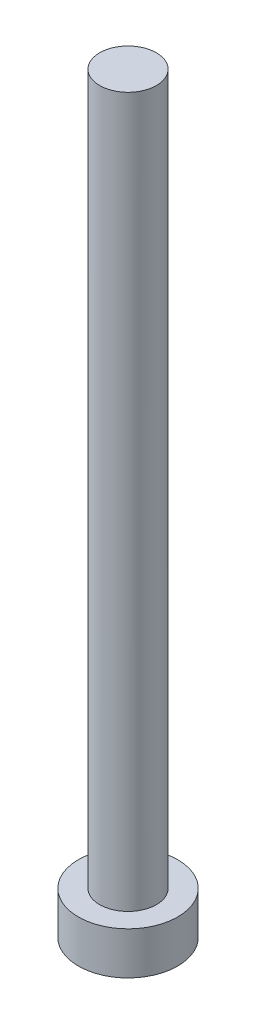
ISO-10303-21;
HEADER;
FILE_DESCRIPTION(('STEP AP214'),'2;1');
FILE_NAME('part.step','',(''),(''),'','','');
FILE_SCHEMA(('AUTOMOTIVE_DESIGN { 1 0 10303 214 1 1 1 1 }'));
ENDSEC;
DATA;
#1=APPLICATION_CONTEXT('core data for automotive mechanical design processes');
#2=APPLICATION_PROTOCOL_DEFINITION('international standard','automotive_design',2000,#1);
#3=PRODUCT_CONTEXT('',#1,'mechanical');
#4=PRODUCT('Part','Part','',(#3));
#5=PRODUCT_RELATED_PRODUCT_CATEGORY('part','',(#4));
#6=PRODUCT_DEFINITION_FORMATION('','',#4);
#7=PRODUCT_DEFINITION_CONTEXT('part definition',#1,'design');
#8=PRODUCT_DEFINITION('design','',#6,#7);
#9=PRODUCT_DEFINITION_SHAPE('','',#8);
#10=(LENGTH_UNIT() NAMED_UNIT(*) SI_UNIT(.MILLI.,.METRE.));
#11=(NAMED_UNIT(*) PLANE_ANGLE_UNIT() SI_UNIT($,.RADIAN.));
#12=(NAMED_UNIT(*) SI_UNIT($,.STERADIAN.) SOLID_ANGLE_UNIT());
#13=UNCERTAINTY_MEASURE_WITH_UNIT(LENGTH_MEASURE(1.E-05),#10,'distance_accuracy_value','');
#14=(GEOMETRIC_REPRESENTATION_CONTEXT(3) GLOBAL_UNCERTAINTY_ASSIGNED_CONTEXT((#13)) GLOBAL_UNIT_ASSIGNED_CONTEXT((#10,
#11,#12)) REPRESENTATION_CONTEXT('',''));
#15=CARTESIAN_POINT('',(0.,0.,0.));
#16=DIRECTION('',(0.,0.,1.));
#17=DIRECTION('',(1.,0.,0.));
#18=AXIS2_PLACEMENT_3D('',#15,#16,#17);
#19=CARTESIAN_POINT('',(0.,50.,0.));
#20=DIRECTION('',(0.,-1.,0.));
#21=DIRECTION('',(0.,0.,-1.));
#22=AXIS2_PLACEMENT_3D('',#19,#20,#21);
#23=CYLINDRICAL_SURFACE('',#22,2.);
#24=CARTESIAN_POINT('',(0.,50.,0.));
#25=DIRECTION('',(0.,1.,0.));
#26=DIRECTION('',(0.,0.,1.));
#27=AXIS2_PLACEMENT_3D('',#24,#25,#26);
#28=CIRCLE('',#27,2.);
#29=CARTESIAN_POINT('',(0.,50.,2.));
#30=VERTEX_POINT('',#29);
#31=EDGE_CURVE('E10',#30,#30,#28,.T.);
#32=ORIENTED_EDGE('',*,*,#31,.F.);
#33=EDGE_LOOP('',(#32));
#34=FACE_BOUND('',#33,.T.);
#35=CARTESIAN_POINT('',(0.,0.,0.));
#36=DIRECTION('',(0.,-1.,0.));
#37=DIRECTION('',(0.,0.,-1.));
#38=AXIS2_PLACEMENT_3D('',#35,#36,#37);
#39=CIRCLE('',#38,2.);
#40=CARTESIAN_POINT('',(0.,0.,-2.));
#41=VERTEX_POINT('',#40);
#42=EDGE_CURVE('E36',#41,#41,#39,.T.);
#43=ORIENTED_EDGE('',*,*,#42,.F.);
#44=EDGE_LOOP('',(#43));
#45=FACE_BOUND('',#44,.T.);
#46=ADVANCED_FACE('F30',(#34,#45),#23,.T.);
#47=CARTESIAN_POINT('',(0.,50.,0.));
#48=DIRECTION('',(0.,1.,0.));
#49=DIRECTION('',(0.,0.,1.));
#50=AXIS2_PLACEMENT_3D('',#47,#48,#49);
#51=PLANE('',#50);
#52=ORIENTED_EDGE('',*,*,#31,.T.);
#53=EDGE_LOOP('',(#52));
#54=FACE_BOUND('',#53,.T.);
#55=ADVANCED_FACE('F63',(#54),#51,.T.);
#56=CARTESIAN_POINT('',(0.,-3.,0.));
#57=DIRECTION('',(0.,1.,0.));
#58=DIRECTION('',(0.,0.,1.));
#59=AXIS2_PLACEMENT_3D('',#56,#57,#58);
#60=CYLINDRICAL_SURFACE('',#59,3.5);
#61=CARTESIAN_POINT('',(0.,-3.,0.));
#62=DIRECTION('',(0.,-1.,0.));
#63=DIRECTION('',(0.,0.,-1.));
#64=AXIS2_PLACEMENT_3D('',#61,#62,#63);
#65=CIRCLE('',#64,3.5);
#66=CARTESIAN_POINT('',(0.,-3.,-3.5));
#67=VERTEX_POINT('',#66);
#68=EDGE_CURVE('E40',#67,#67,#65,.T.);
#69=ORIENTED_EDGE('',*,*,#68,.F.);
#70=EDGE_LOOP('',(#69));
#71=FACE_BOUND('',#70,.T.);
#72=CARTESIAN_POINT('',(0.,0.,0.));
#73=DIRECTION('',(0.,-1.,0.));
#74=DIRECTION('',(0.,0.,-1.));
#75=AXIS2_PLACEMENT_3D('',#72,#73,#74);
#76=CIRCLE('',#75,3.5);
#77=CARTESIAN_POINT('',(0.,0.,-3.5));
#78=VERTEX_POINT('',#77);
#79=EDGE_CURVE('E44',#78,#78,#76,.T.);
#80=ORIENTED_EDGE('',*,*,#79,.T.);
#81=EDGE_LOOP('',(#80));
#82=FACE_BOUND('',#81,.T.);
#83=ADVANCED_FACE('F50',(#71,#82),#60,.T.);
#84=CARTESIAN_POINT('',(0.,-3.,0.));
#85=DIRECTION('',(0.,-1.,0.));
#86=DIRECTION('',(0.,0.,-1.));
#87=AXIS2_PLACEMENT_3D('',#84,#85,#86);
#88=PLANE('',#87);
#89=ORIENTED_EDGE('',*,*,#68,.T.);
#90=EDGE_LOOP('',(#89));
#91=FACE_BOUND('',#90,.T.);
#92=ADVANCED_FACE('F54',(#91),#88,.T.);
#93=CARTESIAN_POINT('',(0.,0.,0.));
#94=DIRECTION('',(0.,-1.,0.));
#95=DIRECTION('',(0.,0.,-1.));
#96=AXIS2_PLACEMENT_3D('',#93,#94,#95);
#97=PLANE('',#96);
#98=ORIENTED_EDGE('',*,*,#42,.T.);
#99=EDGE_LOOP('',(#98));
#100=FACE_BOUND('',#99,.T.);
#101=ORIENTED_EDGE('',*,*,#79,.F.);
#102=EDGE_LOOP('',(#101));
#103=FACE_BOUND('',#102,.T.);
#104=ADVANCED_FACE('F52',(#100,#103),#97,.F.);
#105=CLOSED_SHELL('',(#46,#55,#83,#92,#104));
#106=MANIFOLD_SOLID_BREP('B2',#105);
#107=ADVANCED_BREP_SHAPE_REPRESENTATION('',(#18,#106),#14);
#108=SHAPE_DEFINITION_REPRESENTATION(#9,#107);
ENDSEC;
END-ISO-10303-21;
